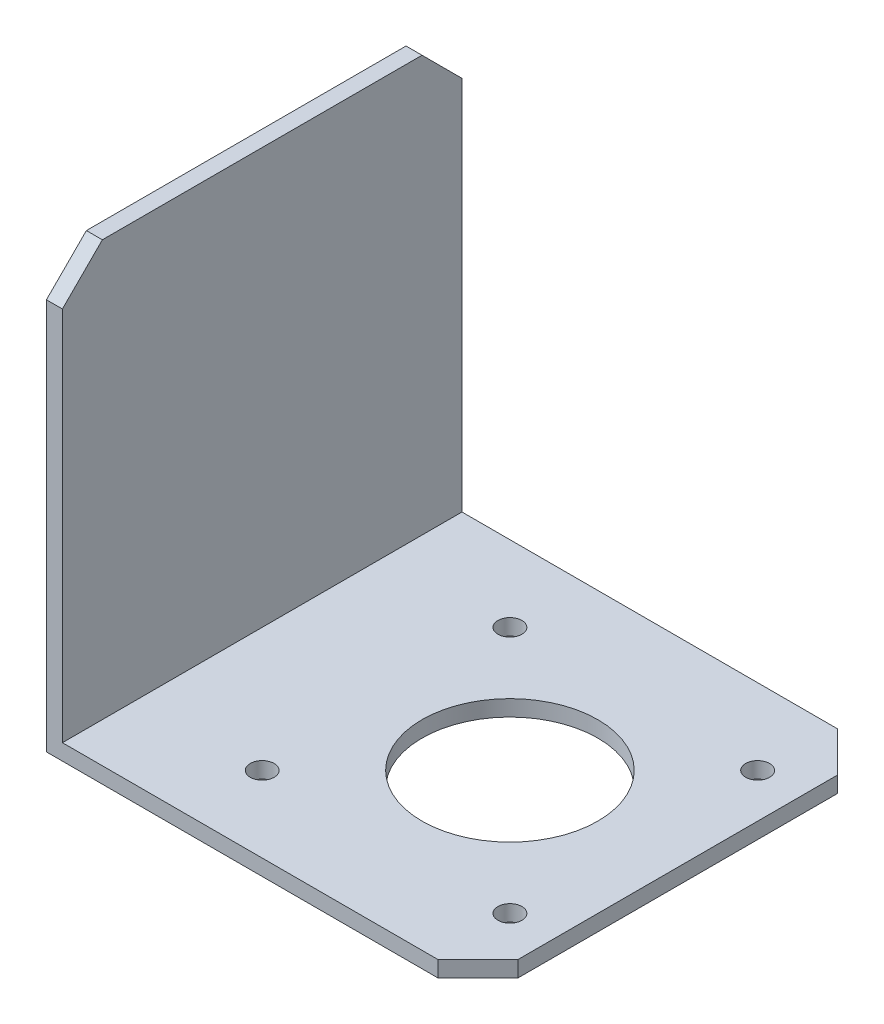
ISO-10303-21;
HEADER;
FILE_DESCRIPTION(('STEP AP214'),'2;1');
FILE_NAME('part.step','',(''),(''),'','','');
FILE_SCHEMA(('AUTOMOTIVE_DESIGN { 1 0 10303 214 1 1 1 1 }'));
ENDSEC;
DATA;
#1=APPLICATION_CONTEXT('core data for automotive mechanical design processes');
#2=APPLICATION_PROTOCOL_DEFINITION('international standard','automotive_design',2000,#1);
#3=PRODUCT_CONTEXT('',#1,'mechanical');
#4=PRODUCT('Part','Part','',(#3));
#5=PRODUCT_RELATED_PRODUCT_CATEGORY('part','',(#4));
#6=PRODUCT_DEFINITION_FORMATION('','',#4);
#7=PRODUCT_DEFINITION_CONTEXT('part definition',#1,'design');
#8=PRODUCT_DEFINITION('design','',#6,#7);
#9=PRODUCT_DEFINITION_SHAPE('','',#8);
#10=(LENGTH_UNIT() NAMED_UNIT(*) SI_UNIT(.MILLI.,.METRE.));
#11=(NAMED_UNIT(*) PLANE_ANGLE_UNIT() SI_UNIT($,.RADIAN.));
#12=(NAMED_UNIT(*) SI_UNIT($,.STERADIAN.) SOLID_ANGLE_UNIT());
#13=UNCERTAINTY_MEASURE_WITH_UNIT(LENGTH_MEASURE(1.E-05),#10,'distance_accuracy_value','');
#14=(GEOMETRIC_REPRESENTATION_CONTEXT(3) GLOBAL_UNCERTAINTY_ASSIGNED_CONTEXT((#13)) GLOBAL_UNIT_ASSIGNED_CONTEXT((#10,
#11,#12)) REPRESENTATION_CONTEXT('',''));
#15=CARTESIAN_POINT('',(0.,0.,0.));
#16=DIRECTION('',(0.,0.,1.));
#17=DIRECTION('',(1.,0.,0.));
#18=AXIS2_PLACEMENT_3D('',#15,#16,#17);
#19=CARTESIAN_POINT('',(0.,-2.,50.));
#20=DIRECTION('',(0.,1.,0.));
#21=DIRECTION('',(0.,0.,1.));
#22=AXIS2_PLACEMENT_3D('',#19,#20,#21);
#23=PLANE('',#22);
#24=CARTESIAN_POINT('',(31.,-2.,25.));
#25=DIRECTION('',(0.,-1.,0.));
#26=DIRECTION('',(0.,0.,-1.));
#27=AXIS2_PLACEMENT_3D('',#24,#25,#26);
#28=CIRCLE('',#27,11.);
#29=CARTESIAN_POINT('',(31.,-2.,14.));
#30=VERTEX_POINT('',#29);
#31=EDGE_CURVE('E277',#30,#30,#28,.T.);
#32=ORIENTED_EDGE('',*,*,#31,.F.);
#33=EDGE_LOOP('',(#32));
#34=FACE_BOUND('',#33,.T.);
#35=CARTESIAN_POINT('',(15.5,-2.,40.5));
#36=DIRECTION('',(0.,-1.,0.));
#37=DIRECTION('',(0.,0.,-1.));
#38=AXIS2_PLACEMENT_3D('',#35,#36,#37);
#39=CIRCLE('',#38,1.5);
#40=CARTESIAN_POINT('',(15.5,-2.,39.));
#41=VERTEX_POINT('',#40);
#42=EDGE_CURVE('E281',#41,#41,#39,.T.);
#43=ORIENTED_EDGE('',*,*,#42,.F.);
#44=EDGE_LOOP('',(#43));
#45=FACE_BOUND('',#44,.T.);
#46=CARTESIAN_POINT('',(15.5,-2.,9.5));
#47=DIRECTION('',(0.,-1.,0.));
#48=DIRECTION('',(0.,0.,-1.));
#49=AXIS2_PLACEMENT_3D('',#46,#47,#48);
#50=CIRCLE('',#49,1.5);
#51=CARTESIAN_POINT('',(15.5,-2.,8.));
#52=VERTEX_POINT('',#51);
#53=EDGE_CURVE('E274',#52,#52,#50,.T.);
#54=ORIENTED_EDGE('',*,*,#53,.F.);
#55=EDGE_LOOP('',(#54));
#56=FACE_BOUND('',#55,.T.);
#57=CARTESIAN_POINT('',(46.5,-2.,9.5));
#58=DIRECTION('',(0.,-1.,0.));
#59=DIRECTION('',(0.,0.,-1.));
#60=AXIS2_PLACEMENT_3D('',#57,#58,#59);
#61=CIRCLE('',#60,1.5);
#62=CARTESIAN_POINT('',(46.5,-2.,7.99999999999999));
#63=VERTEX_POINT('',#62);
#64=EDGE_CURVE('E271',#63,#63,#61,.T.);
#65=ORIENTED_EDGE('',*,*,#64,.F.);
#66=EDGE_LOOP('',(#65));
#67=FACE_BOUND('',#66,.T.);
#68=CARTESIAN_POINT('',(46.5,-2.,40.5));
#69=DIRECTION('',(0.,-1.,0.));
#70=DIRECTION('',(0.,0.,-1.));
#71=AXIS2_PLACEMENT_3D('',#68,#69,#70);
#72=CIRCLE('',#71,1.5);
#73=CARTESIAN_POINT('',(46.5,-2.,39.));
#74=VERTEX_POINT('',#73);
#75=EDGE_CURVE('E232',#74,#74,#72,.T.);
#76=ORIENTED_EDGE('',*,*,#75,.F.);
#77=EDGE_LOOP('',(#76));
#78=FACE_BOUND('',#77,.T.);
#79=DIRECTION('',(1.,0.,0.));
#80=VECTOR('',#79,1.);
#81=CARTESIAN_POINT('',(0.,-2.,0.));
#82=LINE('',#81,#80);
#83=CARTESIAN_POINT('',(-2.,-2.,0.));
#84=VERTEX_POINT('',#83);
#85=CARTESIAN_POINT('',(47.,-2.,0.));
#86=VERTEX_POINT('',#85);
#87=EDGE_CURVE('E155',#84,#86,#82,.T.);
#88=ORIENTED_EDGE('',*,*,#87,.T.);
#89=DIRECTION('',(-0.707106781186547,0.,-0.707106781186549));
#90=VECTOR('',#89,1.);
#91=CARTESIAN_POINT('',(47.,-2.,0.));
#92=LINE('',#91,#90);
#93=CARTESIAN_POINT('',(52.,-2.,5.00000000000003));
#94=VERTEX_POINT('',#93);
#95=EDGE_CURVE('E210',#86,#94,#92,.F.);
#96=ORIENTED_EDGE('',*,*,#95,.T.);
#97=DIRECTION('',(0.,0.,-1.));
#98=VECTOR('',#97,1.);
#99=CARTESIAN_POINT('',(52.,-2.,50.));
#100=LINE('',#99,#98);
#101=CARTESIAN_POINT('',(52.,-2.,45.));
#102=VERTEX_POINT('',#101);
#103=EDGE_CURVE('E178',#102,#94,#100,.T.);
#104=ORIENTED_EDGE('',*,*,#103,.F.);
#105=DIRECTION('',(-0.707106781186549,0.,0.707106781186546));
#106=VECTOR('',#105,1.);
#107=CARTESIAN_POINT('',(52.,-2.,45.));
#108=LINE('',#107,#106);
#109=CARTESIAN_POINT('',(47.,-2.,50.));
#110=VERTEX_POINT('',#109);
#111=EDGE_CURVE('E207',#102,#110,#108,.T.);
#112=ORIENTED_EDGE('',*,*,#111,.T.);
#113=DIRECTION('',(1.,0.,0.));
#114=VECTOR('',#113,1.);
#115=CARTESIAN_POINT('',(0.,-2.,50.));
#116=LINE('',#115,#114);
#117=CARTESIAN_POINT('',(-2.,-2.,50.));
#118=VERTEX_POINT('',#117);
#119=EDGE_CURVE('E145',#118,#110,#116,.T.);
#120=ORIENTED_EDGE('',*,*,#119,.F.);
#121=DIRECTION('',(0.,0.,-1.));
#122=VECTOR('',#121,1.);
#123=CARTESIAN_POINT('',(-2.,-2.,50.));
#124=LINE('',#123,#122);
#125=EDGE_CURVE('E154',#118,#84,#124,.T.);
#126=ORIENTED_EDGE('',*,*,#125,.T.);
#127=EDGE_LOOP('',(#88,#96,#104,#112,#120,#126));
#128=FACE_BOUND('',#127,.T.);
#129=ADVANCED_FACE('F39',(#34,#45,#56,#67,#78,#128),#23,.F.);
#130=CARTESIAN_POINT('',(52.,0.,50.));
#131=DIRECTION('',(1.,0.,0.));
#132=DIRECTION('',(0.,0.,-1.));
#133=AXIS2_PLACEMENT_3D('',#130,#131,#132);
#134=PLANE('',#133);
#135=ORIENTED_EDGE('',*,*,#103,.T.);
#136=DIRECTION('',(0.,1.,0.));
#137=VECTOR('',#136,1.);
#138=CARTESIAN_POINT('',(52.,0.,5.00000000000003));
#139=LINE('',#138,#137);
#140=CARTESIAN_POINT('',(52.,0.,5.00000000000003));
#141=VERTEX_POINT('',#140);
#142=EDGE_CURVE('E63',#94,#141,#139,.T.);
#143=ORIENTED_EDGE('',*,*,#142,.T.);
#144=DIRECTION('',(0.,0.,-1.));
#145=VECTOR('',#144,1.);
#146=CARTESIAN_POINT('',(52.,0.,50.));
#147=LINE('',#146,#145);
#148=CARTESIAN_POINT('',(52.,0.,45.));
#149=VERTEX_POINT('',#148);
#150=EDGE_CURVE('E140',#149,#141,#147,.T.);
#151=ORIENTED_EDGE('',*,*,#150,.F.);
#152=DIRECTION('',(0.,-1.,0.));
#153=VECTOR('',#152,1.);
#154=CARTESIAN_POINT('',(52.,-2.,45.));
#155=LINE('',#154,#153);
#156=EDGE_CURVE('E213',#149,#102,#155,.T.);
#157=ORIENTED_EDGE('',*,*,#156,.T.);
#158=EDGE_LOOP('',(#135,#143,#151,#157));
#159=FACE_BOUND('',#158,.T.);
#160=ADVANCED_FACE('F253',(#159),#134,.T.);
#161=CARTESIAN_POINT('',(0.,0.,50.));
#162=DIRECTION('',(0.,1.,0.));
#163=DIRECTION('',(0.,0.,1.));
#164=AXIS2_PLACEMENT_3D('',#161,#162,#163);
#165=PLANE('',#164);
#166=CARTESIAN_POINT('',(31.,0.,25.));
#167=DIRECTION('',(0.,1.,0.));
#168=DIRECTION('',(0.,0.,1.));
#169=AXIS2_PLACEMENT_3D('',#166,#167,#168);
#170=CIRCLE('',#169,11.);
#171=CARTESIAN_POINT('',(31.,0.,36.));
#172=VERTEX_POINT('',#171);
#173=EDGE_CURVE('E43',#172,#172,#170,.T.);
#174=ORIENTED_EDGE('',*,*,#173,.F.);
#175=EDGE_LOOP('',(#174));
#176=FACE_BOUND('',#175,.T.);
#177=CARTESIAN_POINT('',(15.5,0.,40.5));
#178=DIRECTION('',(0.,1.,0.));
#179=DIRECTION('',(0.,0.,1.));
#180=AXIS2_PLACEMENT_3D('',#177,#178,#179);
#181=CIRCLE('',#180,1.5);
#182=CARTESIAN_POINT('',(15.5,0.,42.));
#183=VERTEX_POINT('',#182);
#184=EDGE_CURVE('E239',#183,#183,#181,.T.);
#185=ORIENTED_EDGE('',*,*,#184,.F.);
#186=EDGE_LOOP('',(#185));
#187=FACE_BOUND('',#186,.T.);
#188=CARTESIAN_POINT('',(15.5,0.,9.5));
#189=DIRECTION('',(0.,1.,0.));
#190=DIRECTION('',(0.,0.,1.));
#191=AXIS2_PLACEMENT_3D('',#188,#189,#190);
#192=CIRCLE('',#191,1.5);
#193=CARTESIAN_POINT('',(15.5,0.,11.));
#194=VERTEX_POINT('',#193);
#195=EDGE_CURVE('E236',#194,#194,#192,.T.);
#196=ORIENTED_EDGE('',*,*,#195,.F.);
#197=EDGE_LOOP('',(#196));
#198=FACE_BOUND('',#197,.T.);
#199=CARTESIAN_POINT('',(46.5,0.,9.5));
#200=DIRECTION('',(0.,1.,0.));
#201=DIRECTION('',(0.,0.,1.));
#202=AXIS2_PLACEMENT_3D('',#199,#200,#201);
#203=CIRCLE('',#202,1.5);
#204=CARTESIAN_POINT('',(46.5,0.,11.));
#205=VERTEX_POINT('',#204);
#206=EDGE_CURVE('E231',#205,#205,#203,.T.);
#207=ORIENTED_EDGE('',*,*,#206,.F.);
#208=EDGE_LOOP('',(#207));
#209=FACE_BOUND('',#208,.T.);
#210=CARTESIAN_POINT('',(46.5,0.,40.5));
#211=DIRECTION('',(0.,1.,0.));
#212=DIRECTION('',(0.,0.,1.));
#213=AXIS2_PLACEMENT_3D('',#210,#211,#212);
#214=CIRCLE('',#213,1.5);
#215=CARTESIAN_POINT('',(46.5,0.,42.));
#216=VERTEX_POINT('',#215);
#217=EDGE_CURVE('E227',#216,#216,#214,.T.);
#218=ORIENTED_EDGE('',*,*,#217,.F.);
#219=EDGE_LOOP('',(#218));
#220=FACE_BOUND('',#219,.T.);
#221=ORIENTED_EDGE('',*,*,#150,.T.);
#222=DIRECTION('',(0.707106781186546,0.,0.707106781186548));
#223=VECTOR('',#222,1.);
#224=CARTESIAN_POINT('',(48.5000000000001,0.,1.50000000000008));
#225=LINE('',#224,#223);
#226=CARTESIAN_POINT('',(47.,0.,0.));
#227=VERTEX_POINT('',#226);
#228=EDGE_CURVE('E222',#141,#227,#225,.F.);
#229=ORIENTED_EDGE('',*,*,#228,.T.);
#230=DIRECTION('',(1.,0.,0.));
#231=VECTOR('',#230,1.);
#232=CARTESIAN_POINT('',(0.,0.,0.));
#233=LINE('',#232,#231);
#234=CARTESIAN_POINT('',(0.,0.,0.));
#235=VERTEX_POINT('',#234);
#236=EDGE_CURVE('E138',#235,#227,#233,.T.);
#237=ORIENTED_EDGE('',*,*,#236,.F.);
#238=DIRECTION('',(0.,0.,-1.));
#239=VECTOR('',#238,1.);
#240=CARTESIAN_POINT('',(0.,0.,50.));
#241=LINE('',#240,#239);
#242=CARTESIAN_POINT('',(0.,0.,50.));
#243=VERTEX_POINT('',#242);
#244=EDGE_CURVE('E125',#243,#235,#241,.T.);
#245=ORIENTED_EDGE('',*,*,#244,.F.);
#246=DIRECTION('',(1.,0.,0.));
#247=VECTOR('',#246,1.);
#248=CARTESIAN_POINT('',(0.,0.,50.));
#249=LINE('',#248,#247);
#250=CARTESIAN_POINT('',(47.,0.,50.));
#251=VERTEX_POINT('',#250);
#252=EDGE_CURVE('E132',#243,#251,#249,.T.);
#253=ORIENTED_EDGE('',*,*,#252,.T.);
#254=DIRECTION('',(0.70710678118655,0.,-0.707106781186546));
#255=VECTOR('',#254,1.);
#256=CARTESIAN_POINT('',(23.4999999999999,0.,73.5));
#257=LINE('',#256,#255);
#258=EDGE_CURVE('E219',#251,#149,#257,.T.);
#259=ORIENTED_EDGE('',*,*,#258,.T.);
#260=EDGE_LOOP('',(#221,#229,#237,#245,#253,#259));
#261=FACE_BOUND('',#260,.T.);
#262=ADVANCED_FACE('F135',(#176,#187,#198,#209,#220,#261),#165,.T.);
#263=CARTESIAN_POINT('',(0.,0.,50.));
#264=DIRECTION('',(1.,0.,0.));
#265=DIRECTION('',(0.,0.,-1.));
#266=AXIS2_PLACEMENT_3D('',#263,#264,#265);
#267=PLANE('',#266);
#268=DIRECTION('',(0.,-1.,0.));
#269=VECTOR('',#268,1.);
#270=CARTESIAN_POINT('',(0.,0.,0.));
#271=LINE('',#270,#269);
#272=CARTESIAN_POINT('',(0.,47.,0.));
#273=VERTEX_POINT('',#272);
#274=EDGE_CURVE('E161',#273,#235,#271,.T.);
#275=ORIENTED_EDGE('',*,*,#274,.F.);
#276=DIRECTION('',(0.,-0.707106781186546,-0.707106781186548));
#277=VECTOR('',#276,1.);
#278=CARTESIAN_POINT('',(0.,48.5000000000001,1.50000000000008));
#279=LINE('',#278,#277);
#280=CARTESIAN_POINT('',(0.,52.,5.00000000000003));
#281=VERTEX_POINT('',#280);
#282=EDGE_CURVE('E191',#273,#281,#279,.F.);
#283=ORIENTED_EDGE('',*,*,#282,.T.);
#284=DIRECTION('',(0.,0.,-1.));
#285=VECTOR('',#284,1.);
#286=CARTESIAN_POINT('',(0.,52.,50.));
#287=LINE('',#286,#285);
#288=CARTESIAN_POINT('',(0.,52.,45.));
#289=VERTEX_POINT('',#288);
#290=EDGE_CURVE('E141',#289,#281,#287,.T.);
#291=ORIENTED_EDGE('',*,*,#290,.F.);
#292=DIRECTION('',(0.,-0.70710678118655,0.707106781186546));
#293=VECTOR('',#292,1.);
#294=CARTESIAN_POINT('',(0.,23.4999999999999,73.5));
#295=LINE('',#294,#293);
#296=CARTESIAN_POINT('',(0.,47.,50.));
#297=VERTEX_POINT('',#296);
#298=EDGE_CURVE('E128',#289,#297,#295,.T.);
#299=ORIENTED_EDGE('',*,*,#298,.T.);
#300=DIRECTION('',(0.,-1.,0.));
#301=VECTOR('',#300,1.);
#302=CARTESIAN_POINT('',(0.,0.,50.));
#303=LINE('',#302,#301);
#304=EDGE_CURVE('E121',#297,#243,#303,.T.);
#305=ORIENTED_EDGE('',*,*,#304,.T.);
#306=ORIENTED_EDGE('',*,*,#244,.T.);
#307=EDGE_LOOP('',(#275,#283,#291,#299,#305,#306));
#308=FACE_BOUND('',#307,.T.);
#309=ADVANCED_FACE('F124',(#308),#267,.T.);
#310=CARTESIAN_POINT('',(-2.,52.,50.));
#311=DIRECTION('',(0.,1.,0.));
#312=DIRECTION('',(0.,0.,1.));
#313=AXIS2_PLACEMENT_3D('',#310,#311,#312);
#314=PLANE('',#313);
#315=ORIENTED_EDGE('',*,*,#290,.T.);
#316=DIRECTION('',(-1.,0.,0.));
#317=VECTOR('',#316,1.);
#318=CARTESIAN_POINT('',(-2.,52.,5.00000000000003));
#319=LINE('',#318,#317);
#320=CARTESIAN_POINT('',(-2.,52.,5.00000000000003));
#321=VERTEX_POINT('',#320);
#322=EDGE_CURVE('E198',#281,#321,#319,.T.);
#323=ORIENTED_EDGE('',*,*,#322,.T.);
#324=DIRECTION('',(0.,0.,-1.));
#325=VECTOR('',#324,1.);
#326=CARTESIAN_POINT('',(-2.,52.,50.));
#327=LINE('',#326,#325);
#328=CARTESIAN_POINT('',(-2.,52.,45.));
#329=VERTEX_POINT('',#328);
#330=EDGE_CURVE('E169',#329,#321,#327,.T.);
#331=ORIENTED_EDGE('',*,*,#330,.F.);
#332=DIRECTION('',(1.,0.,0.));
#333=VECTOR('',#332,1.);
#334=CARTESIAN_POINT('',(0.,52.,45.));
#335=LINE('',#334,#333);
#336=EDGE_CURVE('E194',#329,#289,#335,.T.);
#337=ORIENTED_EDGE('',*,*,#336,.T.);
#338=EDGE_LOOP('',(#315,#323,#331,#337));
#339=FACE_BOUND('',#338,.T.);
#340=ADVANCED_FACE('F322',(#339),#314,.T.);
#341=CARTESIAN_POINT('',(-2.,0.,50.));
#342=DIRECTION('',(1.,0.,0.));
#343=DIRECTION('',(0.,0.,-1.));
#344=AXIS2_PLACEMENT_3D('',#341,#342,#343);
#345=PLANE('',#344);
#346=ORIENTED_EDGE('',*,*,#330,.T.);
#347=DIRECTION('',(0.,0.707106781186547,0.707106781186549));
#348=VECTOR('',#347,1.);
#349=CARTESIAN_POINT('',(-2.,47.,0.));
#350=LINE('',#349,#348);
#351=CARTESIAN_POINT('',(-2.,47.,0.));
#352=VERTEX_POINT('',#351);
#353=EDGE_CURVE('E204',#321,#352,#350,.F.);
#354=ORIENTED_EDGE('',*,*,#353,.T.);
#355=DIRECTION('',(0.,1.,0.));
#356=VECTOR('',#355,1.);
#357=CARTESIAN_POINT('',(-2.,0.,0.));
#358=LINE('',#357,#356);
#359=EDGE_CURVE('E148',#352,#84,#358,.F.);
#360=ORIENTED_EDGE('',*,*,#359,.T.);
#361=ORIENTED_EDGE('',*,*,#125,.F.);
#362=DIRECTION('',(0.,1.,0.));
#363=VECTOR('',#362,1.);
#364=CARTESIAN_POINT('',(-2.,0.,50.));
#365=LINE('',#364,#363);
#366=CARTESIAN_POINT('',(-2.,47.,50.));
#367=VERTEX_POINT('',#366);
#368=EDGE_CURVE('E131',#367,#118,#365,.F.);
#369=ORIENTED_EDGE('',*,*,#368,.F.);
#370=DIRECTION('',(0.,0.707106781186549,-0.707106781186546));
#371=VECTOR('',#370,1.);
#372=CARTESIAN_POINT('',(-2.,52.,45.));
#373=LINE('',#372,#371);
#374=EDGE_CURVE('E201',#367,#329,#373,.T.);
#375=ORIENTED_EDGE('',*,*,#374,.T.);
#376=EDGE_LOOP('',(#346,#354,#360,#361,#369,#375));
#377=FACE_BOUND('',#376,.T.);
#378=ADVANCED_FACE('F315',(#377),#345,.F.);
#379=CARTESIAN_POINT('',(0.,0.,50.));
#380=DIRECTION('',(0.,0.,-1.));
#381=DIRECTION('',(-1.,0.,0.));
#382=AXIS2_PLACEMENT_3D('',#379,#380,#381);
#383=PLANE('',#382);
#384=ORIENTED_EDGE('',*,*,#119,.T.);
#385=DIRECTION('',(0.,1.,0.));
#386=VECTOR('',#385,1.);
#387=CARTESIAN_POINT('',(47.,0.,50.));
#388=LINE('',#387,#386);
#389=EDGE_CURVE('E11',#110,#251,#388,.T.);
#390=ORIENTED_EDGE('',*,*,#389,.T.);
#391=ORIENTED_EDGE('',*,*,#252,.F.);
#392=ORIENTED_EDGE('',*,*,#304,.F.);
#393=DIRECTION('',(-1.,0.,0.));
#394=VECTOR('',#393,1.);
#395=CARTESIAN_POINT('',(-2.,47.,50.));
#396=LINE('',#395,#394);
#397=EDGE_CURVE('E49',#297,#367,#396,.T.);
#398=ORIENTED_EDGE('',*,*,#397,.T.);
#399=ORIENTED_EDGE('',*,*,#368,.T.);
#400=EDGE_LOOP('',(#384,#390,#391,#392,#398,#399));
#401=FACE_BOUND('',#400,.T.);
#402=ADVANCED_FACE('F143',(#401),#383,.F.);
#403=CARTESIAN_POINT('',(0.,0.,0.));
#404=DIRECTION('',(0.,0.,-1.));
#405=DIRECTION('',(-1.,0.,0.));
#406=AXIS2_PLACEMENT_3D('',#403,#404,#405);
#407=PLANE('',#406);
#408=ORIENTED_EDGE('',*,*,#359,.F.);
#409=DIRECTION('',(1.,0.,0.));
#410=VECTOR('',#409,1.);
#411=CARTESIAN_POINT('',(0.,47.,0.));
#412=LINE('',#411,#410);
#413=EDGE_CURVE('E185',#352,#273,#412,.T.);
#414=ORIENTED_EDGE('',*,*,#413,.T.);
#415=ORIENTED_EDGE('',*,*,#274,.T.);
#416=ORIENTED_EDGE('',*,*,#236,.T.);
#417=DIRECTION('',(0.,-1.,0.));
#418=VECTOR('',#417,1.);
#419=CARTESIAN_POINT('',(47.,0.,0.));
#420=LINE('',#419,#418);
#421=EDGE_CURVE('E181',#227,#86,#420,.T.);
#422=ORIENTED_EDGE('',*,*,#421,.T.);
#423=ORIENTED_EDGE('',*,*,#87,.F.);
#424=EDGE_LOOP('',(#408,#414,#415,#416,#422,#423));
#425=FACE_BOUND('',#424,.T.);
#426=ADVANCED_FACE('F303',(#425),#407,.T.);
#427=CARTESIAN_POINT('',(0.,47.,0.));
#428=DIRECTION('',(0.,-0.707106781186548,0.707106781186546));
#429=DIRECTION('',(1.,0.,0.));
#430=AXIS2_PLACEMENT_3D('',#427,#428,#429);
#431=PLANE('',#430);
#432=ORIENTED_EDGE('',*,*,#353,.F.);
#433=ORIENTED_EDGE('',*,*,#322,.F.);
#434=ORIENTED_EDGE('',*,*,#282,.F.);
#435=ORIENTED_EDGE('',*,*,#413,.F.);
#436=EDGE_LOOP('',(#432,#433,#434,#435));
#437=FACE_BOUND('',#436,.T.);
#438=ADVANCED_FACE('F320',(#437),#431,.F.);
#439=CARTESIAN_POINT('',(47.,0.,0.));
#440=DIRECTION('',(-0.707106781186548,0.,0.707106781186546));
#441=DIRECTION('',(0.,-1.,0.));
#442=AXIS2_PLACEMENT_3D('',#439,#440,#441);
#443=PLANE('',#442);
#444=ORIENTED_EDGE('',*,*,#228,.F.);
#445=ORIENTED_EDGE('',*,*,#142,.F.);
#446=ORIENTED_EDGE('',*,*,#95,.F.);
#447=ORIENTED_EDGE('',*,*,#421,.F.);
#448=EDGE_LOOP('',(#444,#445,#446,#447));
#449=FACE_BOUND('',#448,.T.);
#450=ADVANCED_FACE('F308',(#449),#443,.F.);
#451=CARTESIAN_POINT('',(52.,0.,45.));
#452=DIRECTION('',(0.707106781186545,0.,0.707106781186549));
#453=DIRECTION('',(0.,1.,0.));
#454=AXIS2_PLACEMENT_3D('',#451,#452,#453);
#455=PLANE('',#454);
#456=ORIENTED_EDGE('',*,*,#258,.F.);
#457=ORIENTED_EDGE('',*,*,#389,.F.);
#458=ORIENTED_EDGE('',*,*,#111,.F.);
#459=ORIENTED_EDGE('',*,*,#156,.F.);
#460=EDGE_LOOP('',(#456,#457,#458,#459));
#461=FACE_BOUND('',#460,.T.);
#462=ADVANCED_FACE('F311',(#461),#455,.T.);
#463=CARTESIAN_POINT('',(-2.,52.,45.));
#464=DIRECTION('',(0.,0.707106781186545,0.707106781186549));
#465=DIRECTION('',(-1.,0.,0.));
#466=AXIS2_PLACEMENT_3D('',#463,#464,#465);
#467=PLANE('',#466);
#468=ORIENTED_EDGE('',*,*,#374,.F.);
#469=ORIENTED_EDGE('',*,*,#397,.F.);
#470=ORIENTED_EDGE('',*,*,#298,.F.);
#471=ORIENTED_EDGE('',*,*,#336,.F.);
#472=EDGE_LOOP('',(#468,#469,#470,#471));
#473=FACE_BOUND('',#472,.T.);
#474=ADVANCED_FACE('F41',(#473),#467,.T.);
#475=CARTESIAN_POINT('',(46.5,8.,40.5));
#476=DIRECTION('',(0.,-1.,0.));
#477=DIRECTION('',(0.,0.,-1.));
#478=AXIS2_PLACEMENT_3D('',#475,#476,#477);
#479=CYLINDRICAL_SURFACE('',#478,1.5);
#480=ORIENTED_EDGE('',*,*,#217,.T.);
#481=EDGE_LOOP('',(#480));
#482=FACE_BOUND('',#481,.T.);
#483=ORIENTED_EDGE('',*,*,#75,.T.);
#484=EDGE_LOOP('',(#483));
#485=FACE_BOUND('',#484,.T.);
#486=ADVANCED_FACE('F262',(#482,#485),#479,.F.);
#487=CARTESIAN_POINT('',(46.5,8.,9.5));
#488=DIRECTION('',(0.,-1.,0.));
#489=DIRECTION('',(0.,0.,-1.));
#490=AXIS2_PLACEMENT_3D('',#487,#488,#489);
#491=CYLINDRICAL_SURFACE('',#490,1.5);
#492=ORIENTED_EDGE('',*,*,#206,.T.);
#493=EDGE_LOOP('',(#492));
#494=FACE_BOUND('',#493,.T.);
#495=ORIENTED_EDGE('',*,*,#64,.T.);
#496=EDGE_LOOP('',(#495));
#497=FACE_BOUND('',#496,.T.);
#498=ADVANCED_FACE('F265',(#494,#497),#491,.F.);
#499=CARTESIAN_POINT('',(15.5,8.,9.5));
#500=DIRECTION('',(0.,-1.,0.));
#501=DIRECTION('',(0.,0.,-1.));
#502=AXIS2_PLACEMENT_3D('',#499,#500,#501);
#503=CYLINDRICAL_SURFACE('',#502,1.5);
#504=ORIENTED_EDGE('',*,*,#195,.T.);
#505=EDGE_LOOP('',(#504));
#506=FACE_BOUND('',#505,.T.);
#507=ORIENTED_EDGE('',*,*,#53,.T.);
#508=EDGE_LOOP('',(#507));
#509=FACE_BOUND('',#508,.T.);
#510=ADVANCED_FACE('F289',(#506,#509),#503,.F.);
#511=CARTESIAN_POINT('',(15.5,8.,40.5));
#512=DIRECTION('',(0.,-1.,0.));
#513=DIRECTION('',(0.,0.,-1.));
#514=AXIS2_PLACEMENT_3D('',#511,#512,#513);
#515=CYLINDRICAL_SURFACE('',#514,1.5);
#516=ORIENTED_EDGE('',*,*,#184,.T.);
#517=EDGE_LOOP('',(#516));
#518=FACE_BOUND('',#517,.T.);
#519=ORIENTED_EDGE('',*,*,#42,.T.);
#520=EDGE_LOOP('',(#519));
#521=FACE_BOUND('',#520,.T.);
#522=ADVANCED_FACE('F350',(#518,#521),#515,.F.);
#523=CARTESIAN_POINT('',(31.,8.,25.));
#524=DIRECTION('',(0.,-1.,0.));
#525=DIRECTION('',(0.,0.,-1.));
#526=AXIS2_PLACEMENT_3D('',#523,#524,#525);
#527=CYLINDRICAL_SURFACE('',#526,11.);
#528=ORIENTED_EDGE('',*,*,#173,.T.);
#529=EDGE_LOOP('',(#528));
#530=FACE_BOUND('',#529,.T.);
#531=ORIENTED_EDGE('',*,*,#31,.T.);
#532=EDGE_LOOP('',(#531));
#533=FACE_BOUND('',#532,.T.);
#534=ADVANCED_FACE('F248',(#530,#533),#527,.F.);
#535=CLOSED_SHELL('',(#129,#160,#262,#309,#340,#378,#402,#426,#438,#450,#462,#474,#486,#498,
#510,#522,#534));
#536=MANIFOLD_SOLID_BREP('B2',#535);
#537=ADVANCED_BREP_SHAPE_REPRESENTATION('',(#18,#536),#14);
#538=SHAPE_DEFINITION_REPRESENTATION(#9,#537);
ENDSEC;
END-ISO-10303-21;
